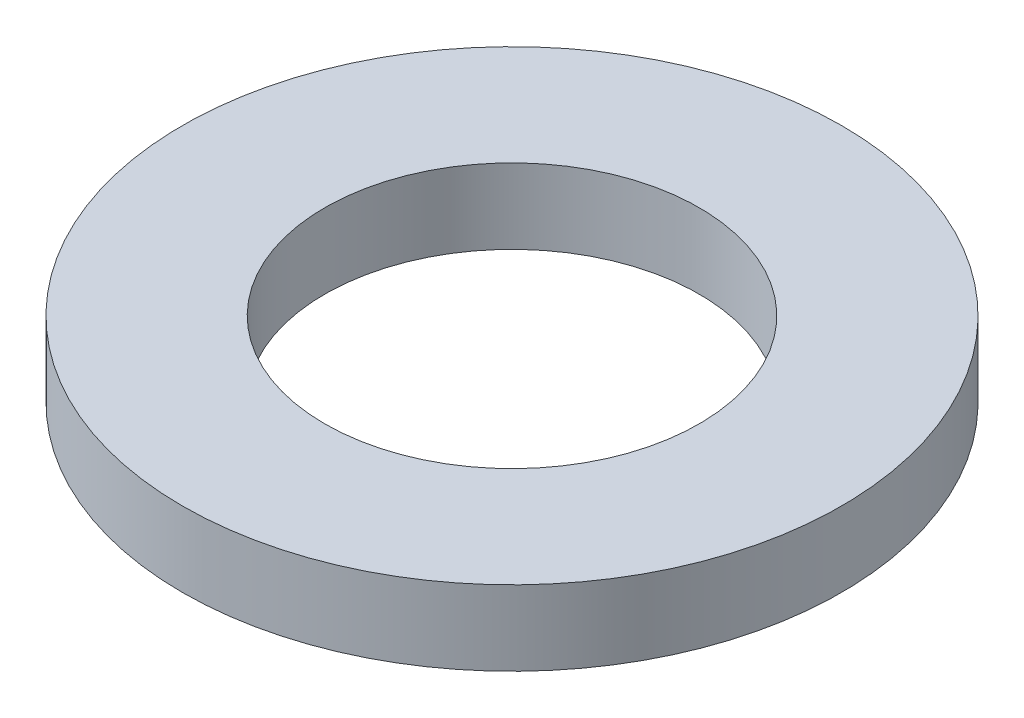
ISO-10303-21;
HEADER;
FILE_DESCRIPTION(('STEP AP214'),'2;1');
FILE_NAME('part.step','',(''),(''),'','','');
FILE_SCHEMA(('AUTOMOTIVE_DESIGN { 1 0 10303 214 1 1 1 1 }'));
ENDSEC;
DATA;
#1=APPLICATION_CONTEXT('core data for automotive mechanical design processes');
#2=APPLICATION_PROTOCOL_DEFINITION('international standard','automotive_design',2000,#1);
#3=PRODUCT_CONTEXT('',#1,'mechanical');
#4=PRODUCT('Part','Part','',(#3));
#5=PRODUCT_RELATED_PRODUCT_CATEGORY('part','',(#4));
#6=PRODUCT_DEFINITION_FORMATION('','',#4);
#7=PRODUCT_DEFINITION_CONTEXT('part definition',#1,'design');
#8=PRODUCT_DEFINITION('design','',#6,#7);
#9=PRODUCT_DEFINITION_SHAPE('','',#8);
#10=(LENGTH_UNIT() NAMED_UNIT(*) SI_UNIT(.MILLI.,.METRE.));
#11=(NAMED_UNIT(*) PLANE_ANGLE_UNIT() SI_UNIT($,.RADIAN.));
#12=(NAMED_UNIT(*) SI_UNIT($,.STERADIAN.) SOLID_ANGLE_UNIT());
#13=UNCERTAINTY_MEASURE_WITH_UNIT(LENGTH_MEASURE(1.E-05),#10,'distance_accuracy_value','');
#14=(GEOMETRIC_REPRESENTATION_CONTEXT(3) GLOBAL_UNCERTAINTY_ASSIGNED_CONTEXT((#13)) GLOBAL_UNIT_ASSIGNED_CONTEXT((#10,
#11,#12)) REPRESENTATION_CONTEXT('',''));
#15=CARTESIAN_POINT('',(0.,0.,0.));
#16=DIRECTION('',(0.,0.,1.));
#17=DIRECTION('',(1.,0.,0.));
#18=AXIS2_PLACEMENT_3D('',#15,#16,#17);
#19=CARTESIAN_POINT('',(0.,5.,0.));
#20=DIRECTION('',(0.,1.,0.));
#21=DIRECTION('',(0.,0.,1.));
#22=AXIS2_PLACEMENT_3D('',#19,#20,#21);
#23=PLANE('',#22);
#24=CARTESIAN_POINT('',(0.,5.,0.));
#25=DIRECTION('',(0.,1.,0.));
#26=DIRECTION('',(0.,0.,1.));
#27=AXIS2_PLACEMENT_3D('',#24,#25,#26);
#28=CIRCLE('',#27,22.);
#29=CARTESIAN_POINT('',(0.,5.,22.));
#30=VERTEX_POINT('',#29);
#31=EDGE_CURVE('E10',#30,#30,#28,.T.);
#32=ORIENTED_EDGE('',*,*,#31,.T.);
#33=EDGE_LOOP('',(#32));
#34=FACE_BOUND('',#33,.T.);
#35=CARTESIAN_POINT('',(0.,5.,0.));
#36=DIRECTION('',(0.,1.,0.));
#37=DIRECTION('',(0.,0.,1.));
#38=AXIS2_PLACEMENT_3D('',#35,#36,#37);
#39=CIRCLE('',#38,12.5);
#40=CARTESIAN_POINT('',(0.,5.,12.5));
#41=VERTEX_POINT('',#40);
#42=EDGE_CURVE('E41',#41,#41,#39,.T.);
#43=ORIENTED_EDGE('',*,*,#42,.F.);
#44=EDGE_LOOP('',(#43));
#45=FACE_BOUND('',#44,.T.);
#46=ADVANCED_FACE('F30',(#34,#45),#23,.T.);
#47=CARTESIAN_POINT('',(0.,0.,0.));
#48=DIRECTION('',(0.,1.,0.));
#49=DIRECTION('',(0.,0.,1.));
#50=AXIS2_PLACEMENT_3D('',#47,#48,#49);
#51=PLANE('',#50);
#52=CARTESIAN_POINT('',(0.,0.,0.));
#53=DIRECTION('',(0.,1.,0.));
#54=DIRECTION('',(0.,0.,1.));
#55=AXIS2_PLACEMENT_3D('',#52,#53,#54);
#56=CIRCLE('',#55,22.);
#57=CARTESIAN_POINT('',(0.,0.,22.));
#58=VERTEX_POINT('',#57);
#59=EDGE_CURVE('E34',#58,#58,#56,.T.);
#60=ORIENTED_EDGE('',*,*,#59,.F.);
#61=EDGE_LOOP('',(#60));
#62=FACE_BOUND('',#61,.T.);
#63=CARTESIAN_POINT('',(0.,0.,0.));
#64=DIRECTION('',(0.,1.,0.));
#65=DIRECTION('',(0.,0.,1.));
#66=AXIS2_PLACEMENT_3D('',#63,#64,#65);
#67=CIRCLE('',#66,12.5);
#68=CARTESIAN_POINT('',(0.,0.,12.5));
#69=VERTEX_POINT('',#68);
#70=EDGE_CURVE('E43',#69,#69,#67,.T.);
#71=ORIENTED_EDGE('',*,*,#70,.T.);
#72=EDGE_LOOP('',(#71));
#73=FACE_BOUND('',#72,.T.);
#74=ADVANCED_FACE('F53',(#62,#73),#51,.F.);
#75=CARTESIAN_POINT('',(0.,5.,0.));
#76=DIRECTION('',(0.,-1.,0.));
#77=DIRECTION('',(0.,0.,-1.));
#78=AXIS2_PLACEMENT_3D('',#75,#76,#77);
#79=CYLINDRICAL_SURFACE('',#78,22.);
#80=ORIENTED_EDGE('',*,*,#31,.F.);
#81=EDGE_LOOP('',(#80));
#82=FACE_BOUND('',#81,.T.);
#83=ORIENTED_EDGE('',*,*,#59,.T.);
#84=EDGE_LOOP('',(#83));
#85=FACE_BOUND('',#84,.T.);
#86=ADVANCED_FACE('F32',(#82,#85),#79,.T.);
#87=CARTESIAN_POINT('',(0.,5.,0.));
#88=DIRECTION('',(0.,-1.,0.));
#89=DIRECTION('',(0.,0.,-1.));
#90=AXIS2_PLACEMENT_3D('',#87,#88,#89);
#91=CYLINDRICAL_SURFACE('',#90,12.5);
#92=ORIENTED_EDGE('',*,*,#42,.T.);
#93=EDGE_LOOP('',(#92));
#94=FACE_BOUND('',#93,.T.);
#95=ORIENTED_EDGE('',*,*,#70,.F.);
#96=EDGE_LOOP('',(#95));
#97=FACE_BOUND('',#96,.T.);
#98=ADVANCED_FACE('F49',(#94,#97),#91,.F.);
#99=CLOSED_SHELL('',(#46,#74,#86,#98));
#100=MANIFOLD_SOLID_BREP('B2',#99);
#101=ADVANCED_BREP_SHAPE_REPRESENTATION('',(#18,#100),#14);
#102=SHAPE_DEFINITION_REPRESENTATION(#9,#101);
ENDSEC;
END-ISO-10303-21;
